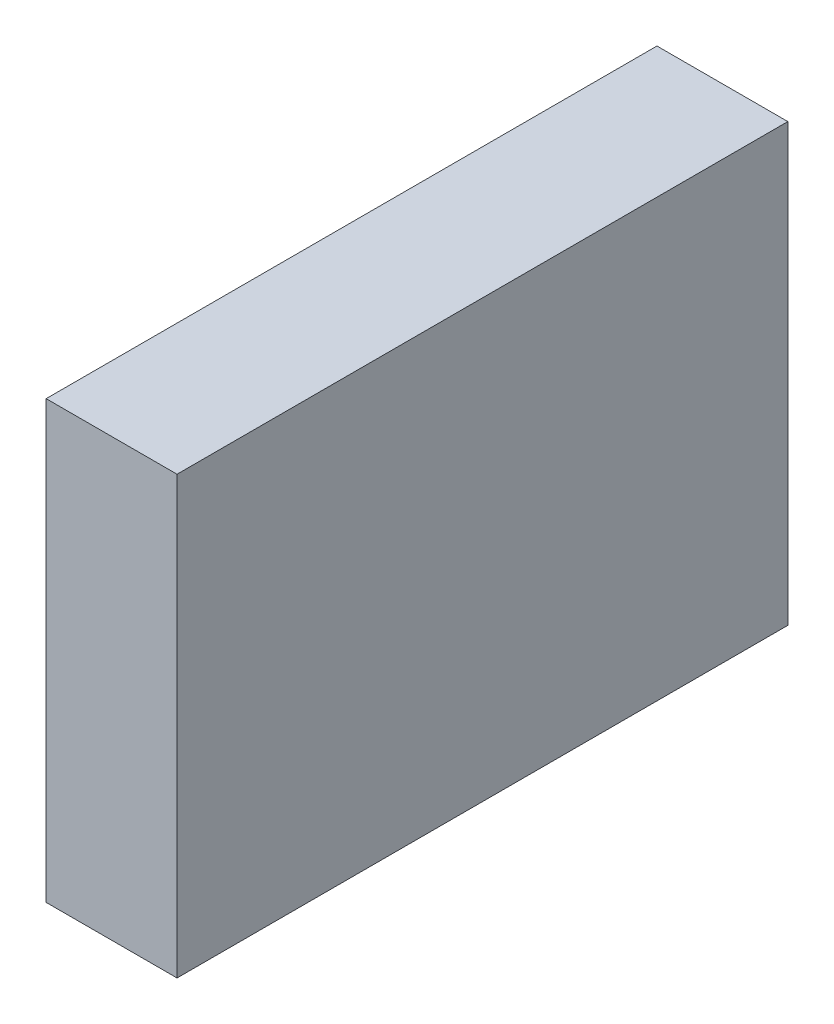
ISO-10303-21;
HEADER;
FILE_DESCRIPTION(('STEP AP214'),'2;1');
FILE_NAME('part.step','',(''),(''),'','','');
FILE_SCHEMA(('AUTOMOTIVE_DESIGN { 1 0 10303 214 1 1 1 1 }'));
ENDSEC;
DATA;
#1=APPLICATION_CONTEXT('core data for automotive mechanical design processes');
#2=APPLICATION_PROTOCOL_DEFINITION('international standard','automotive_design',2000,#1);
#3=PRODUCT_CONTEXT('',#1,'mechanical');
#4=PRODUCT('Part','Part','',(#3));
#5=PRODUCT_RELATED_PRODUCT_CATEGORY('part','',(#4));
#6=PRODUCT_DEFINITION_FORMATION('','',#4);
#7=PRODUCT_DEFINITION_CONTEXT('part definition',#1,'design');
#8=PRODUCT_DEFINITION('design','',#6,#7);
#9=PRODUCT_DEFINITION_SHAPE('','',#8);
#10=(LENGTH_UNIT() NAMED_UNIT(*) SI_UNIT(.MILLI.,.METRE.));
#11=(NAMED_UNIT(*) PLANE_ANGLE_UNIT() SI_UNIT($,.RADIAN.));
#12=(NAMED_UNIT(*) SI_UNIT($,.STERADIAN.) SOLID_ANGLE_UNIT());
#13=UNCERTAINTY_MEASURE_WITH_UNIT(LENGTH_MEASURE(1.E-05),#10,'distance_accuracy_value','');
#14=(GEOMETRIC_REPRESENTATION_CONTEXT(3) GLOBAL_UNCERTAINTY_ASSIGNED_CONTEXT((#13)) GLOBAL_UNIT_ASSIGNED_CONTEXT((#10,
#11,#12)) REPRESENTATION_CONTEXT('',''));
#15=CARTESIAN_POINT('',(0.,0.,0.));
#16=DIRECTION('',(0.,0.,1.));
#17=DIRECTION('',(1.,0.,0.));
#18=AXIS2_PLACEMENT_3D('',#15,#16,#17);
#19=CARTESIAN_POINT('',(3.9,-1.82000017746824,-3.72112168010555));
#20=DIRECTION('',(1.,0.,0.));
#21=DIRECTION('',(0.,1.,8.74227765734759E-08));
#22=AXIS2_PLACEMENT_3D('',#19,#20,#21);
#23=PLANE('',#22);
#24=DIRECTION('',(0.,-8.74227765576152E-08,0.999999999999996));
#25=VECTOR('',#24,1.);
#26=CARTESIAN_POINT('',(3.9,-0.750000183585831,-3.65112158656318));
#27=LINE('',#26,#25);
#28=CARTESIAN_POINT('',(3.9,-0.750000183585831,-3.65112158656218));
#29=VERTEX_POINT('',#28);
#30=CARTESIAN_POINT('',(3.9,-0.750000305978718,-2.25112158656318));
#31=VERTEX_POINT('',#30);
#32=EDGE_CURVE('E11',#29,#31,#27,.T.);
#33=ORIENTED_EDGE('',*,*,#32,.F.);
#34=DIRECTION('',(0.,0.999999999999996,8.74227765733007E-08));
#35=VECTOR('',#34,1.);
#36=CARTESIAN_POINT('',(3.9,-1.75000018358783,-3.65112167398595));
#37=LINE('',#36,#35);
#38=CARTESIAN_POINT('',(3.9,-1.75000018358683,-3.65112167398595));
#39=VERTEX_POINT('',#38);
#40=EDGE_CURVE('E59',#39,#29,#37,.T.);
#41=ORIENTED_EDGE('',*,*,#40,.F.);
#42=DIRECTION('',(0.,8.74227766369168E-08,-0.999999999999996));
#43=VECTOR('',#42,1.);
#44=CARTESIAN_POINT('',(3.9,-1.75000030597972,-2.25112167398595));
#45=LINE('',#44,#43);
#46=CARTESIAN_POINT('',(3.9,-1.75000030597972,-2.25112167398695));
#47=VERTEX_POINT('',#46);
#48=EDGE_CURVE('E79',#47,#39,#45,.T.);
#49=ORIENTED_EDGE('',*,*,#48,.F.);
#50=DIRECTION('',(0.,-0.999999999999996,-8.74227765733007E-08));
#51=VECTOR('',#50,1.);
#52=CARTESIAN_POINT('',(3.9,-0.750000305977718,-2.25112158656318));
#53=LINE('',#52,#51);
#54=EDGE_CURVE('E84',#31,#47,#53,.T.);
#55=ORIENTED_EDGE('',*,*,#54,.F.);
#56=EDGE_LOOP('',(#33,#41,#49,#55));
#57=FACE_BOUND('',#56,.T.);
#58=ADVANCED_FACE('F17',(#57),#23,.F.);
#59=CARTESIAN_POINT('',(4.2,-1.82000017746824,-3.72112168010555));
#60=DIRECTION('',(1.,0.,0.));
#61=DIRECTION('',(0.,1.,8.74227765734759E-08));
#62=AXIS2_PLACEMENT_3D('',#59,#60,#61);
#63=PLANE('',#62);
#64=DIRECTION('',(0.,-0.999999999999996,-8.74227765733007E-08));
#65=VECTOR('',#64,1.);
#66=CARTESIAN_POINT('',(4.2,-0.750000305977718,-2.25112158656318));
#67=LINE('',#66,#65);
#68=CARTESIAN_POINT('',(4.2,-0.750000305978718,-2.25112158656318));
#69=VERTEX_POINT('',#68);
#70=CARTESIAN_POINT('',(4.2,-1.75000030597972,-2.25112167398695));
#71=VERTEX_POINT('',#70);
#72=EDGE_CURVE('E24',#69,#71,#67,.T.);
#73=ORIENTED_EDGE('',*,*,#72,.T.);
#74=DIRECTION('',(0.,8.74227764783136E-08,-0.999999999999996));
#75=VECTOR('',#74,1.);
#76=CARTESIAN_POINT('',(4.2,-1.75000030597972,-2.25112167398595));
#77=LINE('',#76,#75);
#78=CARTESIAN_POINT('',(4.2,-1.75000018358683,-3.65112167398595));
#79=VERTEX_POINT('',#78);
#80=EDGE_CURVE('E82',#71,#79,#77,.T.);
#81=ORIENTED_EDGE('',*,*,#80,.T.);
#82=DIRECTION('',(0.,0.999999999999996,8.74227765733007E-08));
#83=VECTOR('',#82,1.);
#84=CARTESIAN_POINT('',(4.2,-1.75000018358783,-3.65112167398595));
#85=LINE('',#84,#83);
#86=CARTESIAN_POINT('',(4.2,-0.750000183585831,-3.65112158656218));
#87=VERTEX_POINT('',#86);
#88=EDGE_CURVE('E64',#79,#87,#85,.T.);
#89=ORIENTED_EDGE('',*,*,#88,.T.);
#90=DIRECTION('',(0.,-8.74227765576152E-08,0.999999999999996));
#91=VECTOR('',#90,1.);
#92=CARTESIAN_POINT('',(4.2,-0.750000183585831,-3.65112158656318));
#93=LINE('',#92,#91);
#94=EDGE_CURVE('E61',#87,#69,#93,.T.);
#95=ORIENTED_EDGE('',*,*,#94,.T.);
#96=EDGE_LOOP('',(#73,#81,#89,#95));
#97=FACE_BOUND('',#96,.T.);
#98=ADVANCED_FACE('F62',(#97),#63,.T.);
#99=CARTESIAN_POINT('',(3.9,-0.750000305977718,-2.25112158656318));
#100=DIRECTION('',(0.,-8.74227765734759E-08,1.));
#101=DIRECTION('',(0.,-1.,-8.74227765734759E-08));
#102=AXIS2_PLACEMENT_3D('',#99,#100,#101);
#103=PLANE('',#102);
#104=ORIENTED_EDGE('',*,*,#54,.T.);
#105=DIRECTION('',(1.,0.,0.));
#106=VECTOR('',#105,1.);
#107=CARTESIAN_POINT('',(3.9,-1.75000030597972,-2.25112167398595));
#108=LINE('',#107,#106);
#109=EDGE_CURVE('E57',#47,#71,#108,.T.);
#110=ORIENTED_EDGE('',*,*,#109,.T.);
#111=ORIENTED_EDGE('',*,*,#72,.F.);
#112=DIRECTION('',(1.,0.,0.));
#113=VECTOR('',#112,1.);
#114=CARTESIAN_POINT('',(3.9,-0.750000305977718,-2.25112158656318));
#115=LINE('',#114,#113);
#116=EDGE_CURVE('E55',#31,#69,#115,.T.);
#117=ORIENTED_EDGE('',*,*,#116,.F.);
#118=EDGE_LOOP('',(#104,#110,#111,#117));
#119=FACE_BOUND('',#118,.T.);
#120=ADVANCED_FACE('F53',(#119),#103,.T.);
#121=CARTESIAN_POINT('',(3.9,-1.75000030597972,-2.25112167398595));
#122=DIRECTION('',(0.,-1.,-8.74227765734759E-08));
#123=DIRECTION('',(0.,8.74227765734759E-08,-1.));
#124=AXIS2_PLACEMENT_3D('',#121,#122,#123);
#125=PLANE('',#124);
#126=ORIENTED_EDGE('',*,*,#48,.T.);
#127=DIRECTION('',(1.,0.,0.));
#128=VECTOR('',#127,1.);
#129=CARTESIAN_POINT('',(3.9,-1.75000018358783,-3.65112167398595));
#130=LINE('',#129,#128);
#131=EDGE_CURVE('E68',#39,#79,#130,.T.);
#132=ORIENTED_EDGE('',*,*,#131,.T.);
#133=ORIENTED_EDGE('',*,*,#80,.F.);
#134=ORIENTED_EDGE('',*,*,#109,.F.);
#135=EDGE_LOOP('',(#126,#132,#133,#134));
#136=FACE_BOUND('',#135,.T.);
#137=ADVANCED_FACE('F91',(#136),#125,.T.);
#138=CARTESIAN_POINT('',(3.9,-1.75000018358783,-3.65112167398595));
#139=DIRECTION('',(0.,8.74227765734759E-08,-1.));
#140=DIRECTION('',(0.,1.,8.74227765734759E-08));
#141=AXIS2_PLACEMENT_3D('',#138,#139,#140);
#142=PLANE('',#141);
#143=ORIENTED_EDGE('',*,*,#40,.T.);
#144=DIRECTION('',(1.,0.,0.));
#145=VECTOR('',#144,1.);
#146=CARTESIAN_POINT('',(3.9,-0.750000183585831,-3.65112158656318));
#147=LINE('',#146,#145);
#148=EDGE_CURVE('E69',#29,#87,#147,.T.);
#149=ORIENTED_EDGE('',*,*,#148,.T.);
#150=ORIENTED_EDGE('',*,*,#88,.F.);
#151=ORIENTED_EDGE('',*,*,#131,.F.);
#152=EDGE_LOOP('',(#143,#149,#150,#151));
#153=FACE_BOUND('',#152,.T.);
#154=ADVANCED_FACE('F88',(#153),#142,.T.);
#155=CARTESIAN_POINT('',(3.9,-0.750000183585831,-3.65112158656318));
#156=DIRECTION('',(0.,1.,8.74227765734759E-08));
#157=DIRECTION('',(0.,-8.74227765734759E-08,1.));
#158=AXIS2_PLACEMENT_3D('',#155,#156,#157);
#159=PLANE('',#158);
#160=ORIENTED_EDGE('',*,*,#32,.T.);
#161=ORIENTED_EDGE('',*,*,#116,.T.);
#162=ORIENTED_EDGE('',*,*,#94,.F.);
#163=ORIENTED_EDGE('',*,*,#148,.F.);
#164=EDGE_LOOP('',(#160,#161,#162,#163));
#165=FACE_BOUND('',#164,.T.);
#166=ADVANCED_FACE('F71',(#165),#159,.T.);
#167=CLOSED_SHELL('',(#58,#98,#120,#137,#154,#166));
#168=MANIFOLD_SOLID_BREP('B1',#167);
#169=ADVANCED_BREP_SHAPE_REPRESENTATION('',(#18,#168),#14);
#170=SHAPE_DEFINITION_REPRESENTATION(#9,#169);
ENDSEC;
END-ISO-10303-21;
